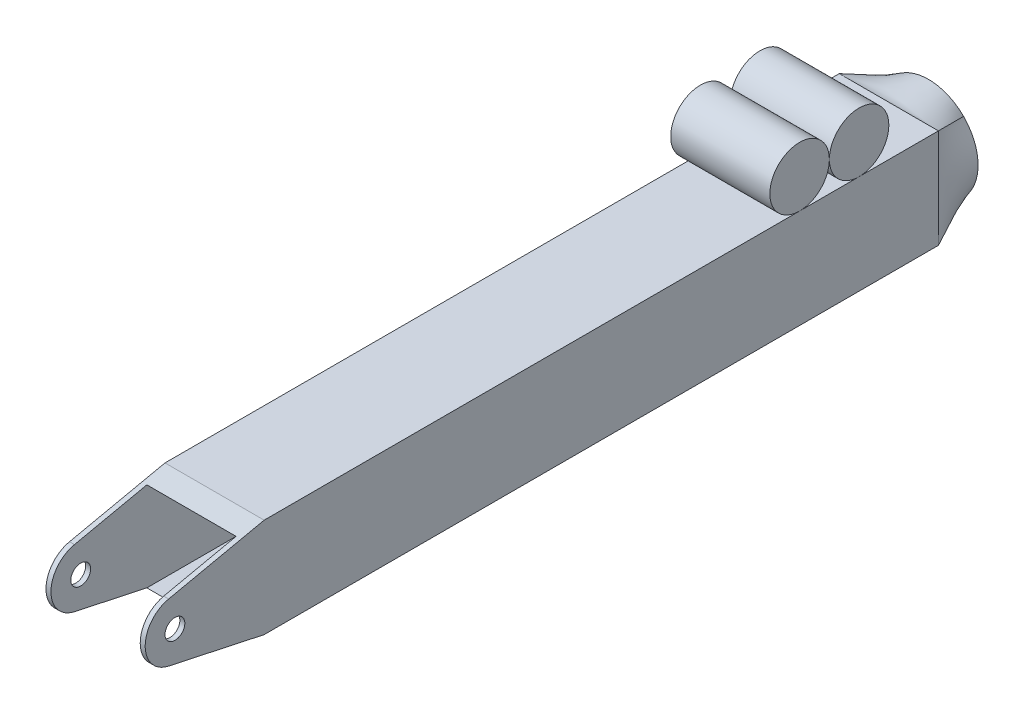
ISO-10303-21;
HEADER;
FILE_DESCRIPTION(('STEP AP214'),'2;1');
FILE_NAME('part.step','',(''),(''),'','','');
FILE_SCHEMA(('AUTOMOTIVE_DESIGN { 1 0 10303 214 1 1 1 1 }'));
ENDSEC;
DATA;
#1=APPLICATION_CONTEXT('core data for automotive mechanical design processes');
#2=APPLICATION_PROTOCOL_DEFINITION('international standard','automotive_design',2000,#1);
#3=PRODUCT_CONTEXT('',#1,'mechanical');
#4=PRODUCT('Part','Part','',(#3));
#5=PRODUCT_RELATED_PRODUCT_CATEGORY('part','',(#4));
#6=PRODUCT_DEFINITION_FORMATION('','',#4);
#7=PRODUCT_DEFINITION_CONTEXT('part definition',#1,'design');
#8=PRODUCT_DEFINITION('design','',#6,#7);
#9=PRODUCT_DEFINITION_SHAPE('','',#8);
#10=(LENGTH_UNIT() NAMED_UNIT(*) SI_UNIT(.MILLI.,.METRE.));
#11=(NAMED_UNIT(*) PLANE_ANGLE_UNIT() SI_UNIT($,.RADIAN.));
#12=(NAMED_UNIT(*) SI_UNIT($,.STERADIAN.) SOLID_ANGLE_UNIT());
#13=UNCERTAINTY_MEASURE_WITH_UNIT(LENGTH_MEASURE(1.E-05),#10,'distance_accuracy_value','');
#14=(GEOMETRIC_REPRESENTATION_CONTEXT(3) GLOBAL_UNCERTAINTY_ASSIGNED_CONTEXT((#13)) GLOBAL_UNIT_ASSIGNED_CONTEXT((#10,
#11,#12)) REPRESENTATION_CONTEXT('',''));
#15=CARTESIAN_POINT('',(0.,0.,0.));
#16=DIRECTION('',(0.,0.,1.));
#17=DIRECTION('',(1.,0.,0.));
#18=AXIS2_PLACEMENT_3D('',#15,#16,#17);
#19=CARTESIAN_POINT('',(-85.631536726415,50.8,76.2));
#20=DIRECTION('',(1.,0.,0.));
#21=DIRECTION('',(0.,0.,-1.));
#22=AXIS2_PLACEMENT_3D('',#19,#20,#21);
#23=CYLINDRICAL_SURFACE('',#22,19.05);
#24=CARTESIAN_POINT('',(-31.75,50.8,76.2));
#25=DIRECTION('',(1.,0.,0.));
#26=DIRECTION('',(0.,0.,-1.));
#27=AXIS2_PLACEMENT_3D('',#24,#25,#26);
#28=CIRCLE('',#27,19.05);
#29=CARTESIAN_POINT('',(-31.75,50.8,57.15));
#30=VERTEX_POINT('',#29);
#31=EDGE_CURVE('E12',#30,#30,#28,.F.);
#32=ORIENTED_EDGE('',*,*,#31,.F.);
#33=EDGE_LOOP('',(#32));
#34=FACE_BOUND('',#33,.T.);
#35=CARTESIAN_POINT('',(31.75,50.8,76.2));
#36=DIRECTION('',(1.,0.,0.));
#37=DIRECTION('',(0.,0.,-1.));
#38=AXIS2_PLACEMENT_3D('',#35,#36,#37);
#39=CIRCLE('',#38,19.05);
#40=CARTESIAN_POINT('',(31.75,50.8,57.15));
#41=VERTEX_POINT('',#40);
#42=EDGE_CURVE('E139',#41,#41,#39,.T.);
#43=ORIENTED_EDGE('',*,*,#42,.F.);
#44=EDGE_LOOP('',(#43));
#45=FACE_BOUND('',#44,.T.);
#46=ADVANCED_FACE('F133',(#34,#45),#23,.T.);
#47=CARTESIAN_POINT('',(31.75,0.,0.));
#48=DIRECTION('',(1.,0.,0.));
#49=DIRECTION('',(0.,0.,-1.));
#50=AXIS2_PLACEMENT_3D('',#47,#48,#49);
#51=PLANE('',#50);
#52=ORIENTED_EDGE('',*,*,#42,.T.);
#53=EDGE_LOOP('',(#52));
#54=FACE_BOUND('',#53,.T.);
#55=ADVANCED_FACE('F145',(#54),#51,.T.);
#56=CARTESIAN_POINT('',(-31.75,-31.75,533.4));
#57=DIRECTION('',(1.,0.,0.));
#58=DIRECTION('',(0.,0.,-1.));
#59=AXIS2_PLACEMENT_3D('',#56,#57,#58);
#60=PLANE('',#59);
#61=ORIENTED_EDGE('',*,*,#31,.T.);
#62=EDGE_LOOP('',(#61));
#63=FACE_BOUND('',#62,.T.);
#64=ADVANCED_FACE('F152',(#63),#60,.F.);
#65=CLOSED_SHELL('',(#46,#55,#64));
#66=MANIFOLD_SOLID_BREP('B2',#65);
#67=CARTESIAN_POINT('',(-85.631536726415,50.8,114.3));
#68=DIRECTION('',(1.,0.,0.));
#69=DIRECTION('',(0.,0.,-1.));
#70=AXIS2_PLACEMENT_3D('',#67,#68,#69);
#71=CYLINDRICAL_SURFACE('',#70,19.05);
#72=CARTESIAN_POINT('',(-31.75,50.8,114.3));
#73=DIRECTION('',(1.,0.,0.));
#74=DIRECTION('',(0.,0.,-1.));
#75=AXIS2_PLACEMENT_3D('',#72,#73,#74);
#76=CIRCLE('',#75,19.05);
#77=CARTESIAN_POINT('',(-31.75,50.8,95.25));
#78=VERTEX_POINT('',#77);
#79=EDGE_CURVE('E132',#78,#78,#76,.F.);
#80=ORIENTED_EDGE('',*,*,#79,.F.);
#81=EDGE_LOOP('',(#80));
#82=FACE_BOUND('',#81,.T.);
#83=CARTESIAN_POINT('',(31.75,50.8,114.3));
#84=DIRECTION('',(1.,0.,0.));
#85=DIRECTION('',(0.,0.,-1.));
#86=AXIS2_PLACEMENT_3D('',#83,#84,#85);
#87=CIRCLE('',#86,19.05);
#88=CARTESIAN_POINT('',(31.75,50.8,95.25));
#89=VERTEX_POINT('',#88);
#90=EDGE_CURVE('E189',#89,#89,#87,.T.);
#91=ORIENTED_EDGE('',*,*,#90,.F.);
#92=EDGE_LOOP('',(#91));
#93=FACE_BOUND('',#92,.T.);
#94=ADVANCED_FACE('F183',(#82,#93),#71,.T.);
#95=CARTESIAN_POINT('',(31.75,0.,0.));
#96=DIRECTION('',(1.,0.,0.));
#97=DIRECTION('',(0.,0.,-1.));
#98=AXIS2_PLACEMENT_3D('',#95,#96,#97);
#99=PLANE('',#98);
#100=ORIENTED_EDGE('',*,*,#90,.T.);
#101=EDGE_LOOP('',(#100));
#102=FACE_BOUND('',#101,.T.);
#103=ADVANCED_FACE('F195',(#102),#99,.T.);
#104=CARTESIAN_POINT('',(-31.75,-31.75,533.4));
#105=DIRECTION('',(1.,0.,0.));
#106=DIRECTION('',(0.,0.,-1.));
#107=AXIS2_PLACEMENT_3D('',#104,#105,#106);
#108=PLANE('',#107);
#109=ORIENTED_EDGE('',*,*,#79,.T.);
#110=EDGE_LOOP('',(#109));
#111=FACE_BOUND('',#110,.T.);
#112=ADVANCED_FACE('F202',(#111),#108,.F.);
#113=CLOSED_SHELL('',(#94,#103,#112));
#114=MANIFOLD_SOLID_BREP('B7',#113);
#115=CARTESIAN_POINT('',(31.75,-31.75,533.4));
#116=DIRECTION('',(-1.,0.,0.));
#117=DIRECTION('',(0.,0.,1.));
#118=AXIS2_PLACEMENT_3D('',#115,#116,#117);
#119=PLANE('',#118);
#120=CARTESIAN_POINT('',(31.75,0.,514.35));
#121=DIRECTION('',(1.,0.,0.));
#122=DIRECTION('',(0.,0.,-1.));
#123=AXIS2_PLACEMENT_3D('',#120,#121,#122);
#124=CIRCLE('',#123,6.34999999999994);
#125=CARTESIAN_POINT('',(31.75,0.,508.));
#126=VERTEX_POINT('',#125);
#127=EDGE_CURVE('E355',#126,#126,#124,.T.);
#128=ORIENTED_EDGE('',*,*,#127,.F.);
#129=EDGE_LOOP('',(#128));
#130=FACE_BOUND('',#129,.T.);
#131=CARTESIAN_POINT('',(31.75,0.,514.35));
#132=DIRECTION('',(1.,0.,0.));
#133=DIRECTION('',(0.,0.,-1.));
#134=AXIS2_PLACEMENT_3D('',#131,#132,#133);
#135=CIRCLE('',#134,19.05);
#136=CARTESIAN_POINT('',(31.75,18.6258176426221,518.347676468123));
#137=VERTEX_POINT('',#136);
#138=CARTESIAN_POINT('',(31.75,-18.625817642622,518.347676468123));
#139=VERTEX_POINT('',#138);
#140=EDGE_CURVE('E338',#137,#139,#135,.T.);
#141=ORIENTED_EDGE('',*,*,#140,.T.);
#142=DIRECTION('',(0.,-0.20985178310359,-0.977733209586462));
#143=VECTOR('',#142,1.);
#144=CARTESIAN_POINT('',(31.75,-124.159665832419,26.6485039160112));
#145=LINE('',#144,#143);
#146=CARTESIAN_POINT('',(31.75,-31.75,457.2));
#147=VERTEX_POINT('',#146);
#148=EDGE_CURVE('E341',#139,#147,#145,.T.);
#149=ORIENTED_EDGE('',*,*,#148,.T.);
#150=DIRECTION('',(0.,0.,-1.));
#151=VECTOR('',#150,1.);
#152=CARTESIAN_POINT('',(31.75,-31.75,533.4));
#153=LINE('',#152,#151);
#154=CARTESIAN_POINT('',(31.75,-31.75,25.4));
#155=VERTEX_POINT('',#154);
#156=EDGE_CURVE('E479',#147,#155,#153,.T.);
#157=ORIENTED_EDGE('',*,*,#156,.T.);
#158=DIRECTION('',(0.,1.,0.));
#159=VECTOR('',#158,1.);
#160=CARTESIAN_POINT('',(31.75,-31.75,25.4));
#161=LINE('',#160,#159);
#162=CARTESIAN_POINT('',(31.75,31.75,25.4));
#163=VERTEX_POINT('',#162);
#164=EDGE_CURVE('E473',#155,#163,#161,.T.);
#165=ORIENTED_EDGE('',*,*,#164,.T.);
#166=DIRECTION('',(0.,0.,-1.));
#167=VECTOR('',#166,1.);
#168=CARTESIAN_POINT('',(31.75,31.75,533.4));
#169=LINE('',#168,#167);
#170=CARTESIAN_POINT('',(31.75,31.75,457.2));
#171=VERTEX_POINT('',#170);
#172=EDGE_CURVE('E268',#171,#163,#169,.T.);
#173=ORIENTED_EDGE('',*,*,#172,.F.);
#174=DIRECTION('',(0.,0.20985178310359,-0.977733209586462));
#175=VECTOR('',#174,1.);
#176=CARTESIAN_POINT('',(31.75,124.159665832419,26.6485039160111));
#177=LINE('',#176,#175);
#178=EDGE_CURVE('E343',#137,#171,#177,.T.);
#179=ORIENTED_EDGE('',*,*,#178,.F.);
#180=EDGE_LOOP('',(#141,#149,#157,#165,#173,#179));
#181=FACE_BOUND('',#180,.T.);
#182=ADVANCED_FACE('F224',(#130,#181),#119,.F.);
#183=CARTESIAN_POINT('',(-31.75,-31.75,533.4));
#184=DIRECTION('',(1.,0.,0.));
#185=DIRECTION('',(0.,0.,-1.));
#186=AXIS2_PLACEMENT_3D('',#183,#184,#185);
#187=PLANE('',#186);
#188=CARTESIAN_POINT('',(-31.75,0.,514.35));
#189=DIRECTION('',(1.,0.,0.));
#190=DIRECTION('',(0.,0.,-1.));
#191=AXIS2_PLACEMENT_3D('',#188,#189,#190);
#192=CIRCLE('',#191,6.34999999999994);
#193=CARTESIAN_POINT('',(-31.75,0.,508.));
#194=VERTEX_POINT('',#193);
#195=EDGE_CURVE('E346',#194,#194,#192,.T.);
#196=ORIENTED_EDGE('',*,*,#195,.T.);
#197=EDGE_LOOP('',(#196));
#198=FACE_BOUND('',#197,.T.);
#199=DIRECTION('',(0.,-0.20985178310359,-0.977733209586462));
#200=VECTOR('',#199,1.);
#201=CARTESIAN_POINT('',(-31.75,-16.1153558237338,530.044321859572));
#202=LINE('',#201,#200);
#203=CARTESIAN_POINT('',(-31.75,-18.625817642622,518.347676468123));
#204=VERTEX_POINT('',#203);
#205=CARTESIAN_POINT('',(-31.75,-31.75,457.2));
#206=VERTEX_POINT('',#205);
#207=EDGE_CURVE('E368',#204,#206,#202,.T.);
#208=ORIENTED_EDGE('',*,*,#207,.F.);
#209=CARTESIAN_POINT('',(-31.75,0.,514.35));
#210=DIRECTION('',(1.,0.,0.));
#211=DIRECTION('',(0.,0.,-1.));
#212=AXIS2_PLACEMENT_3D('',#209,#210,#211);
#213=CIRCLE('',#212,19.05);
#214=CARTESIAN_POINT('',(-31.75,18.6258176426221,518.347676468123));
#215=VERTEX_POINT('',#214);
#216=EDGE_CURVE('E389',#215,#204,#213,.T.);
#217=ORIENTED_EDGE('',*,*,#216,.F.);
#218=DIRECTION('',(0.,0.20985178310359,-0.977733209586462));
#219=VECTOR('',#218,1.);
#220=CARTESIAN_POINT('',(-31.75,13.3189573733774,543.073192006461));
#221=LINE('',#220,#219);
#222=CARTESIAN_POINT('',(-31.75,31.75,457.2));
#223=VERTEX_POINT('',#222);
#224=EDGE_CURVE('E384',#215,#223,#221,.T.);
#225=ORIENTED_EDGE('',*,*,#224,.T.);
#226=DIRECTION('',(0.,0.,-1.));
#227=VECTOR('',#226,1.);
#228=CARTESIAN_POINT('',(-31.75,31.75,533.4));
#229=LINE('',#228,#227);
#230=CARTESIAN_POINT('',(-31.75,31.75,25.4));
#231=VERTEX_POINT('',#230);
#232=EDGE_CURVE('E474',#223,#231,#229,.T.);
#233=ORIENTED_EDGE('',*,*,#232,.T.);
#234=DIRECTION('',(0.,1.,0.));
#235=VECTOR('',#234,1.);
#236=CARTESIAN_POINT('',(-31.75,-31.75,25.4));
#237=LINE('',#236,#235);
#238=CARTESIAN_POINT('',(-31.75,-31.75,25.4));
#239=VERTEX_POINT('',#238);
#240=EDGE_CURVE('E485',#231,#239,#237,.F.);
#241=ORIENTED_EDGE('',*,*,#240,.T.);
#242=DIRECTION('',(0.,0.,-1.));
#243=VECTOR('',#242,1.);
#244=CARTESIAN_POINT('',(-31.75,-31.75,533.4));
#245=LINE('',#244,#243);
#246=EDGE_CURVE('E476',#206,#239,#245,.T.);
#247=ORIENTED_EDGE('',*,*,#246,.F.);
#248=EDGE_LOOP('',(#208,#217,#225,#233,#241,#247));
#249=FACE_BOUND('',#248,.T.);
#250=ADVANCED_FACE('F510',(#198,#249),#187,.F.);
#251=CARTESIAN_POINT('',(-28.575,-28.575,533.4));
#252=DIRECTION('',(1.,0.,0.));
#253=DIRECTION('',(0.,0.,-1.));
#254=AXIS2_PLACEMENT_3D('',#251,#252,#253);
#255=PLANE('',#254);
#256=CARTESIAN_POINT('',(-28.575,0.,514.35));
#257=DIRECTION('',(1.,0.,0.));
#258=DIRECTION('',(0.,0.,-1.));
#259=AXIS2_PLACEMENT_3D('',#256,#257,#258);
#260=CIRCLE('',#259,6.34999999999994);
#261=CARTESIAN_POINT('',(-28.575,0.,508.));
#262=VERTEX_POINT('',#261);
#263=EDGE_CURVE('E370',#262,#262,#260,.T.);
#264=ORIENTED_EDGE('',*,*,#263,.F.);
#265=EDGE_LOOP('',(#264));
#266=FACE_BOUND('',#265,.T.);
#267=CARTESIAN_POINT('',(-28.575,0.,514.35));
#268=DIRECTION('',(1.,0.,0.));
#269=DIRECTION('',(0.,0.,-1.));
#270=AXIS2_PLACEMENT_3D('',#267,#268,#269);
#271=CIRCLE('',#270,19.05);
#272=CARTESIAN_POINT('',(-28.575,18.6258176426221,518.347676468123));
#273=VERTEX_POINT('',#272);
#274=CARTESIAN_POINT('',(-28.575,-18.625817642622,518.347676468123));
#275=VERTEX_POINT('',#274);
#276=EDGE_CURVE('E387',#273,#275,#271,.T.);
#277=ORIENTED_EDGE('',*,*,#276,.T.);
#278=DIRECTION('',(0.,-0.20985178310359,-0.977733209586462));
#279=VECTOR('',#278,1.);
#280=CARTESIAN_POINT('',(-28.575,-15.975535901216,530.695765366917));
#281=LINE('',#280,#279);
#282=CARTESIAN_POINT('',(-28.575,-28.575,471.992835660132));
#283=VERTEX_POINT('',#282);
#284=EDGE_CURVE('E362',#275,#283,#281,.T.);
#285=ORIENTED_EDGE('',*,*,#284,.T.);
#286=DIRECTION('',(0.,0.,-1.));
#287=VECTOR('',#286,1.);
#288=CARTESIAN_POINT('',(-28.575,-28.575,533.4));
#289=LINE('',#288,#287);
#290=CARTESIAN_POINT('',(-28.575,-28.575,25.4));
#291=VERTEX_POINT('',#290);
#292=EDGE_CURVE('E471',#283,#291,#289,.T.);
#293=ORIENTED_EDGE('',*,*,#292,.T.);
#294=DIRECTION('',(0.,-1.,0.));
#295=VECTOR('',#294,1.);
#296=CARTESIAN_POINT('',(-28.575,-28.575,25.4));
#297=LINE('',#296,#295);
#298=CARTESIAN_POINT('',(-28.575,28.575,25.4));
#299=VERTEX_POINT('',#298);
#300=EDGE_CURVE('E448',#299,#291,#297,.T.);
#301=ORIENTED_EDGE('',*,*,#300,.F.);
#302=DIRECTION('',(0.,0.,-1.));
#303=VECTOR('',#302,1.);
#304=CARTESIAN_POINT('',(-28.575,28.575,533.4));
#305=LINE('',#304,#303);
#306=CARTESIAN_POINT('',(-28.575,28.575,471.992835660132));
#307=VERTEX_POINT('',#306);
#308=EDGE_CURVE('E247',#307,#299,#305,.T.);
#309=ORIENTED_EDGE('',*,*,#308,.F.);
#310=DIRECTION('',(0.,0.20985178310359,-0.977733209586462));
#311=VECTOR('',#310,1.);
#312=CARTESIAN_POINT('',(-28.575,13.4587772958952,542.421748499116));
#313=LINE('',#312,#311);
#314=EDGE_CURVE('E239',#273,#307,#313,.T.);
#315=ORIENTED_EDGE('',*,*,#314,.F.);
#316=EDGE_LOOP('',(#277,#285,#293,#301,#309,#315));
#317=FACE_BOUND('',#316,.T.);
#318=ADVANCED_FACE('F501',(#266,#317),#255,.T.);
#319=CARTESIAN_POINT('',(28.575,-28.575,533.4));
#320=DIRECTION('',(-1.,0.,0.));
#321=DIRECTION('',(0.,-1.,0.));
#322=AXIS2_PLACEMENT_3D('',#319,#320,#321);
#323=PLANE('',#322);
#324=CARTESIAN_POINT('',(28.575,0.,514.35));
#325=DIRECTION('',(-1.,0.,0.));
#326=DIRECTION('',(0.,-1.,0.));
#327=AXIS2_PLACEMENT_3D('',#324,#325,#326);
#328=CIRCLE('',#327,6.34999999999994);
#329=CARTESIAN_POINT('',(28.575,-6.34999999999994,514.35));
#330=VERTEX_POINT('',#329);
#331=EDGE_CURVE('E227',#330,#330,#328,.T.);
#332=ORIENTED_EDGE('',*,*,#331,.F.);
#333=EDGE_LOOP('',(#332));
#334=FACE_BOUND('',#333,.T.);
#335=DIRECTION('',(0.,0.20985178310359,0.977733209586462));
#336=VECTOR('',#335,1.);
#337=CARTESIAN_POINT('',(28.575,-15.975535901216,530.695765366917));
#338=LINE('',#337,#336);
#339=CARTESIAN_POINT('',(28.575,-28.575,471.992835660132));
#340=VERTEX_POINT('',#339);
#341=CARTESIAN_POINT('',(28.575,-18.625817642622,518.347676468123));
#342=VERTEX_POINT('',#341);
#343=EDGE_CURVE('E360',#340,#342,#338,.T.);
#344=ORIENTED_EDGE('',*,*,#343,.T.);
#345=CARTESIAN_POINT('',(28.575,0.,514.35));
#346=DIRECTION('',(-1.,0.,0.));
#347=DIRECTION('',(0.,-1.,0.));
#348=AXIS2_PLACEMENT_3D('',#345,#346,#347);
#349=CIRCLE('',#348,19.05);
#350=CARTESIAN_POINT('',(28.575,18.6258176426221,518.347676468123));
#351=VERTEX_POINT('',#350);
#352=EDGE_CURVE('E232',#342,#351,#349,.T.);
#353=ORIENTED_EDGE('',*,*,#352,.T.);
#354=DIRECTION('',(0.,-0.20985178310359,0.977733209586462));
#355=VECTOR('',#354,1.);
#356=CARTESIAN_POINT('',(28.575,13.4587772958952,542.421748499116));
#357=LINE('',#356,#355);
#358=CARTESIAN_POINT('',(28.575,28.575,471.992835660132));
#359=VERTEX_POINT('',#358);
#360=EDGE_CURVE('E379',#359,#351,#357,.T.);
#361=ORIENTED_EDGE('',*,*,#360,.F.);
#362=DIRECTION('',(0.,0.,-1.));
#363=VECTOR('',#362,1.);
#364=CARTESIAN_POINT('',(28.575,28.575,533.4));
#365=LINE('',#364,#363);
#366=CARTESIAN_POINT('',(28.575,28.575,25.4));
#367=VERTEX_POINT('',#366);
#368=EDGE_CURVE('E277',#359,#367,#365,.T.);
#369=ORIENTED_EDGE('',*,*,#368,.T.);
#370=DIRECTION('',(0.,1.,0.));
#371=VECTOR('',#370,1.);
#372=CARTESIAN_POINT('',(28.575,-28.575,25.4));
#373=LINE('',#372,#371);
#374=CARTESIAN_POINT('',(28.575,-28.575,25.4));
#375=VERTEX_POINT('',#374);
#376=EDGE_CURVE('E460',#375,#367,#373,.T.);
#377=ORIENTED_EDGE('',*,*,#376,.F.);
#378=DIRECTION('',(0.,0.,-1.));
#379=VECTOR('',#378,1.);
#380=CARTESIAN_POINT('',(28.575,-28.575,533.4));
#381=LINE('',#380,#379);
#382=EDGE_CURVE('E468',#340,#375,#381,.T.);
#383=ORIENTED_EDGE('',*,*,#382,.F.);
#384=EDGE_LOOP('',(#344,#353,#361,#369,#377,#383));
#385=FACE_BOUND('',#384,.T.);
#386=ADVANCED_FACE('F493',(#334,#385),#323,.T.);
#387=CARTESIAN_POINT('',(-31.75,-31.75,533.4));
#388=DIRECTION('',(0.,1.,0.));
#389=DIRECTION('',(0.,0.,1.));
#390=AXIS2_PLACEMENT_3D('',#387,#388,#389);
#391=PLANE('',#390);
#392=DIRECTION('',(1.,0.,0.));
#393=VECTOR('',#392,1.);
#394=CARTESIAN_POINT('',(-31.7555961775506,-31.75,457.2));
#395=LINE('',#394,#393);
#396=EDGE_CURVE('E359',#206,#147,#395,.T.);
#397=ORIENTED_EDGE('',*,*,#396,.F.);
#398=ORIENTED_EDGE('',*,*,#246,.T.);
#399=DIRECTION('',(1.,0.,0.));
#400=VECTOR('',#399,1.);
#401=CARTESIAN_POINT('',(-31.75,-31.75,25.4));
#402=LINE('',#401,#400);
#403=EDGE_CURVE('E481',#239,#155,#402,.T.);
#404=ORIENTED_EDGE('',*,*,#403,.T.);
#405=ORIENTED_EDGE('',*,*,#156,.F.);
#406=EDGE_LOOP('',(#397,#398,#404,#405));
#407=FACE_BOUND('',#406,.T.);
#408=ADVANCED_FACE('F514',(#407),#391,.F.);
#409=CARTESIAN_POINT('',(-28.575,-28.575,533.4));
#410=DIRECTION('',(0.,1.,0.));
#411=DIRECTION('',(0.,0.,1.));
#412=AXIS2_PLACEMENT_3D('',#409,#410,#411);
#413=PLANE('',#412);
#414=ORIENTED_EDGE('',*,*,#292,.F.);
#415=DIRECTION('',(1.,0.,0.));
#416=VECTOR('',#415,1.);
#417=CARTESIAN_POINT('',(-28.575,-28.575,471.992835660132));
#418=LINE('',#417,#416);
#419=EDGE_CURVE('E181',#283,#340,#418,.T.);
#420=ORIENTED_EDGE('',*,*,#419,.T.);
#421=ORIENTED_EDGE('',*,*,#382,.T.);
#422=DIRECTION('',(1.,0.,0.));
#423=VECTOR('',#422,1.);
#424=CARTESIAN_POINT('',(-28.575,-28.575,25.4));
#425=LINE('',#424,#423);
#426=EDGE_CURVE('E456',#291,#375,#425,.T.);
#427=ORIENTED_EDGE('',*,*,#426,.F.);
#428=EDGE_LOOP('',(#414,#420,#421,#427));
#429=FACE_BOUND('',#428,.T.);
#430=ADVANCED_FACE('F498',(#429),#413,.T.);
#431=CARTESIAN_POINT('',(-31.75,31.75,533.4));
#432=DIRECTION('',(0.,-1.,0.));
#433=DIRECTION('',(0.,0.,-1.));
#434=AXIS2_PLACEMENT_3D('',#431,#432,#433);
#435=PLANE('',#434);
#436=ORIENTED_EDGE('',*,*,#232,.F.);
#437=DIRECTION('',(1.,0.,0.));
#438=VECTOR('',#437,1.);
#439=CARTESIAN_POINT('',(-31.7555961775506,31.75,457.2));
#440=LINE('',#439,#438);
#441=EDGE_CURVE('E377',#223,#171,#440,.T.);
#442=ORIENTED_EDGE('',*,*,#441,.T.);
#443=ORIENTED_EDGE('',*,*,#172,.T.);
#444=DIRECTION('',(1.,0.,0.));
#445=VECTOR('',#444,1.);
#446=CARTESIAN_POINT('',(-31.75,31.75,25.4));
#447=LINE('',#446,#445);
#448=EDGE_CURVE('E483',#163,#231,#447,.F.);
#449=ORIENTED_EDGE('',*,*,#448,.T.);
#450=EDGE_LOOP('',(#436,#442,#443,#449));
#451=FACE_BOUND('',#450,.T.);
#452=ADVANCED_FACE('F607',(#451),#435,.F.);
#453=CARTESIAN_POINT('',(-28.575,28.575,533.4));
#454=DIRECTION('',(0.,-1.,0.));
#455=DIRECTION('',(1.,0.,0.));
#456=AXIS2_PLACEMENT_3D('',#453,#454,#455);
#457=PLANE('',#456);
#458=DIRECTION('',(1.,0.,0.));
#459=VECTOR('',#458,1.);
#460=CARTESIAN_POINT('',(-28.575,28.575,471.992835660132));
#461=LINE('',#460,#459);
#462=EDGE_CURVE('E478',#307,#359,#461,.T.);
#463=ORIENTED_EDGE('',*,*,#462,.F.);
#464=ORIENTED_EDGE('',*,*,#308,.T.);
#465=DIRECTION('',(-1.,0.,0.));
#466=VECTOR('',#465,1.);
#467=CARTESIAN_POINT('',(-28.575,28.575,25.4));
#468=LINE('',#467,#466);
#469=EDGE_CURVE('E463',#367,#299,#468,.T.);
#470=ORIENTED_EDGE('',*,*,#469,.F.);
#471=ORIENTED_EDGE('',*,*,#368,.F.);
#472=EDGE_LOOP('',(#463,#464,#470,#471));
#473=FACE_BOUND('',#472,.T.);
#474=ADVANCED_FACE('F609',(#473),#457,.T.);
#475=CARTESIAN_POINT('',(0.,0.,25.4));
#476=DIRECTION('',(0.,0.,1.));
#477=DIRECTION('',(1.,0.,0.));
#478=AXIS2_PLACEMENT_3D('',#475,#476,#477);
#479=PLANE('',#478);
#480=ORIENTED_EDGE('',*,*,#376,.T.);
#481=ORIENTED_EDGE('',*,*,#469,.T.);
#482=ORIENTED_EDGE('',*,*,#300,.T.);
#483=ORIENTED_EDGE('',*,*,#426,.T.);
#484=EDGE_LOOP('',(#480,#481,#482,#483));
#485=FACE_BOUND('',#484,.T.);
#486=ADVANCED_FACE('F432',(#485),#479,.T.);
#487=CARTESIAN_POINT('',(0.,0.,0.));
#488=DIRECTION('',(0.,0.,1.));
#489=DIRECTION('',(1.,0.,0.));
#490=AXIS2_PLACEMENT_3D('',#487,#488,#489);
#491=PLANE('',#490);
#492=CARTESIAN_POINT('',(0.,0.,0.));
#493=DIRECTION('',(0.,0.,1.));
#494=DIRECTION('',(1.,0.,0.));
#495=AXIS2_PLACEMENT_3D('',#492,#493,#494);
#496=CIRCLE('',#495,31.75);
#497=CARTESIAN_POINT('',(-22.4506403026729,-22.4506403026729,0.));
#498=VERTEX_POINT('',#497);
#499=CARTESIAN_POINT('',(22.4506403026729,-22.4506403026729,0.));
#500=VERTEX_POINT('',#499);
#501=EDGE_CURVE('E399',#498,#500,#496,.T.);
#502=ORIENTED_EDGE('',*,*,#501,.F.);
#503=CARTESIAN_POINT('',(-22.4506403026729,22.4506403026729,0.));
#504=VERTEX_POINT('',#503);
#505=EDGE_CURVE('E391',#504,#498,#496,.T.);
#506=ORIENTED_EDGE('',*,*,#505,.F.);
#507=CARTESIAN_POINT('',(22.4506403026729,22.4506403026729,0.));
#508=VERTEX_POINT('',#507);
#509=EDGE_CURVE('E409',#508,#504,#496,.T.);
#510=ORIENTED_EDGE('',*,*,#509,.F.);
#511=EDGE_CURVE('E406',#500,#508,#496,.T.);
#512=ORIENTED_EDGE('',*,*,#511,.F.);
#513=EDGE_LOOP('',(#502,#506,#510,#512));
#514=FACE_BOUND('',#513,.T.);
#515=ADVANCED_FACE('F421',(#514),#491,.F.);
#516=CARTESIAN_POINT('',(22.4506403026729,22.4506403026729,0.));
#517=CARTESIAN_POINT('',(31.75,31.75,25.4));
#518=CARTESIAN_POINT('',(21.1277236360062,23.7735569693395,0.));
#519=CARTESIAN_POINT('',(29.1041666666667,31.75,25.4));
#520=CARTESIAN_POINT('',(19.6377303136963,25.0283417909468,0.));
#521=CARTESIAN_POINT('',(26.4583333333333,31.75,25.4));
#522=CARTESIAN_POINT('',(16.3435658781563,27.2937025532317,0.));
#523=CARTESIAN_POINT('',(21.1666666666667,31.75,25.4));
#524=CARTESIAN_POINT('',(14.5392265401228,28.3035450280792,0.));
#525=CARTESIAN_POINT('',(18.5208333333333,31.75,25.4));
#526=CARTESIAN_POINT('',(10.6815350260682,29.9730642248736,0.));
#527=CARTESIAN_POINT('',(13.2291666666667,31.75,25.4));
#528=CARTESIAN_POINT('',(8.62848487200939,30.6319226360493,0.));
#529=CARTESIAN_POINT('',(10.5833333333333,31.75,25.4));
#530=CARTESIAN_POINT('',(4.38326675590576,31.5206663653225,0.));
#531=CARTESIAN_POINT('',(5.29166666666666,31.75,25.4));
#532=CARTESIAN_POINT('',(2.19188010089096,31.75,0.));
#533=CARTESIAN_POINT('',(2.64583333333333,31.75,25.4));
#534=CARTESIAN_POINT('',(-2.19188010089096,31.75,0.));
#535=CARTESIAN_POINT('',(-2.64583333333334,31.75,25.4));
#536=CARTESIAN_POINT('',(-4.38326675590576,31.5206663653225,0.));
#537=CARTESIAN_POINT('',(-5.29166666666667,31.75,25.4));
#538=CARTESIAN_POINT('',(-8.62848487200939,30.6319226360493,0.));
#539=CARTESIAN_POINT('',(-10.5833333333333,31.75,25.4));
#540=CARTESIAN_POINT('',(-10.6815350260682,29.9730642248736,0.));
#541=CARTESIAN_POINT('',(-13.2291666666667,31.75,25.4));
#542=CARTESIAN_POINT('',(-14.5392265401228,28.3035450280792,0.));
#543=CARTESIAN_POINT('',(-18.5208333333333,31.75,25.4));
#544=CARTESIAN_POINT('',(-16.3435658781563,27.2937025532317,0.));
#545=CARTESIAN_POINT('',(-21.1666666666667,31.75,25.4));
#546=CARTESIAN_POINT('',(-19.6377303136963,25.0283417909468,0.));
#547=CARTESIAN_POINT('',(-26.4583333333333,31.75,25.4));
#548=CARTESIAN_POINT('',(-21.1277236360062,23.7735569693396,0.));
#549=CARTESIAN_POINT('',(-29.1041666666667,31.75,25.4));
#550=CARTESIAN_POINT('',(-22.4506403026729,22.4506403026729,0.));
#551=CARTESIAN_POINT('',(-31.75,31.75,25.4));
#552=B_SPLINE_SURFACE_WITH_KNOTS('',3,1,((#516,#517),(#518,#519),(#520,#521),(#522,#523),(#524,
#525),(#526,#527),(#528,#529),(#530,#531),(#532,#533),(#534,#535),(#536,#537),(#538,#539),(#540,
#541),(#542,#543),(#544,#545),(#546,#547),(#548,#549),(#550,#551)),.UNSPECIFIED.,.F.,.F.,.F.,(4,
2,2,2,2,2,2,2,4),(2,2),(0.,0.125,0.25,0.375,0.5,0.625,0.75,0.875,1.),(0.,1.),.UNSPECIFIED.);
#553=DIRECTION('',(-0.32512139905576,0.325121399055761,0.888027112059114));
#554=VECTOR('',#553,1.);
#555=CARTESIAN_POINT('',(-27.1003201513364,27.1003201513364,12.7));
#556=LINE('',#555,#554);
#557=EDGE_CURVE('E531',#504,#231,#556,.T.);
#558=DIRECTION('',(-0.32512139905576,-0.32512139905576,-0.888027112059114));
#559=VECTOR('',#558,1.);
#560=CARTESIAN_POINT('',(27.1003201513364,27.1003201513364,12.7));
#561=LINE('',#560,#559);
#562=EDGE_CURVE('E528',#163,#508,#561,.T.);
#563=ORIENTED_EDGE('',*,*,#509,.T.);
#564=ORIENTED_EDGE('',*,*,#557,.T.);
#565=ORIENTED_EDGE('',*,*,#448,.F.);
#566=ORIENTED_EDGE('',*,*,#562,.T.);
#567=EDGE_LOOP('',(#563,#564,#565,#566));
#568=FACE_BOUND('',#567,.T.);
#569=ADVANCED_FACE('F431',(#568),#552,.T.);
#570=CARTESIAN_POINT('',(-22.4506403026729,22.4506403026729,0.));
#571=CARTESIAN_POINT('',(-31.75,31.75,25.4));
#572=CARTESIAN_POINT('',(-23.7735569693396,21.1277236360062,0.));
#573=CARTESIAN_POINT('',(-31.75,29.1041666666667,25.4));
#574=CARTESIAN_POINT('',(-25.0283417909468,19.6377303136963,0.));
#575=CARTESIAN_POINT('',(-31.75,26.4583333333333,25.4));
#576=CARTESIAN_POINT('',(-27.2937025532317,16.3435658781563,0.));
#577=CARTESIAN_POINT('',(-31.75,21.1666666666667,25.4));
#578=CARTESIAN_POINT('',(-28.3035450280792,14.5392265401228,0.));
#579=CARTESIAN_POINT('',(-31.75,18.5208333333333,25.4));
#580=CARTESIAN_POINT('',(-29.9730642248736,10.6815350260682,0.));
#581=CARTESIAN_POINT('',(-31.75,13.2291666666667,25.4));
#582=CARTESIAN_POINT('',(-30.6319226360493,8.62848487200939,0.));
#583=CARTESIAN_POINT('',(-31.75,10.5833333333333,25.4));
#584=CARTESIAN_POINT('',(-31.5206663653225,4.38326675590576,0.));
#585=CARTESIAN_POINT('',(-31.75,5.29166666666666,25.4));
#586=CARTESIAN_POINT('',(-31.75,2.19188010089096,0.));
#587=CARTESIAN_POINT('',(-31.75,2.64583333333333,25.4));
#588=CARTESIAN_POINT('',(-31.75,-2.19188010089096,0.));
#589=CARTESIAN_POINT('',(-31.75,-2.64583333333334,25.4));
#590=CARTESIAN_POINT('',(-31.5206663653225,-4.38326675590576,0.));
#591=CARTESIAN_POINT('',(-31.75,-5.29166666666668,25.4));
#592=CARTESIAN_POINT('',(-30.6319226360493,-8.62848487200939,0.));
#593=CARTESIAN_POINT('',(-31.75,-10.5833333333333,25.4));
#594=CARTESIAN_POINT('',(-29.9730642248736,-10.6815350260682,0.));
#595=CARTESIAN_POINT('',(-31.75,-13.2291666666667,25.4));
#596=CARTESIAN_POINT('',(-28.3035450280792,-14.5392265401228,0.));
#597=CARTESIAN_POINT('',(-31.75,-18.5208333333333,25.4));
#598=CARTESIAN_POINT('',(-27.2937025532317,-16.3435658781563,0.));
#599=CARTESIAN_POINT('',(-31.75,-21.1666666666667,25.4));
#600=CARTESIAN_POINT('',(-25.0283417909468,-19.6377303136963,0.));
#601=CARTESIAN_POINT('',(-31.75,-26.4583333333333,25.4));
#602=CARTESIAN_POINT('',(-23.7735569693396,-21.1277236360062,0.));
#603=CARTESIAN_POINT('',(-31.75,-29.1041666666667,25.4));
#604=CARTESIAN_POINT('',(-22.4506403026729,-22.4506403026729,0.));
#605=CARTESIAN_POINT('',(-31.75,-31.75,25.4));
#606=B_SPLINE_SURFACE_WITH_KNOTS('',3,1,((#570,#571),(#572,#573),(#574,#575),(#576,#577),(#578,
#579),(#580,#581),(#582,#583),(#584,#585),(#586,#587),(#588,#589),(#590,#591),(#592,#593),(#594,
#595),(#596,#597),(#598,#599),(#600,#601),(#602,#603),(#604,#605)),.UNSPECIFIED.,.F.,.F.,.F.,(4,
2,2,2,2,2,2,2,4),(2,2),(0.,0.125,0.25,0.375,0.5,0.625,0.75,0.875,1.),(0.,1.),.UNSPECIFIED.);
#607=DIRECTION('',(-0.32512139905576,-0.325121399055761,0.888027112059114));
#608=VECTOR('',#607,1.);
#609=CARTESIAN_POINT('',(-27.1003201513364,-27.1003201513364,12.7));
#610=LINE('',#609,#608);
#611=EDGE_CURVE('E523',#498,#239,#610,.T.);
#612=ORIENTED_EDGE('',*,*,#505,.T.);
#613=ORIENTED_EDGE('',*,*,#611,.T.);
#614=ORIENTED_EDGE('',*,*,#240,.F.);
#615=ORIENTED_EDGE('',*,*,#557,.F.);
#616=EDGE_LOOP('',(#612,#613,#614,#615));
#617=FACE_BOUND('',#616,.T.);
#618=ADVANCED_FACE('F557',(#617),#606,.T.);
#619=CARTESIAN_POINT('',(22.4506403026729,-22.4506403026729,0.));
#620=CARTESIAN_POINT('',(31.75,-31.75,25.4));
#621=CARTESIAN_POINT('',(23.7735569693395,-21.1277236360062,0.));
#622=CARTESIAN_POINT('',(31.75,-29.1041666666667,25.4));
#623=CARTESIAN_POINT('',(25.0283417909468,-19.6377303136963,0.));
#624=CARTESIAN_POINT('',(31.75,-26.4583333333333,25.4));
#625=CARTESIAN_POINT('',(27.2937025532317,-16.3435658781563,0.));
#626=CARTESIAN_POINT('',(31.75,-21.1666666666667,25.4));
#627=CARTESIAN_POINT('',(28.3035450280792,-14.5392265401228,0.));
#628=CARTESIAN_POINT('',(31.75,-18.5208333333333,25.4));
#629=CARTESIAN_POINT('',(29.9730642248736,-10.6815350260682,0.));
#630=CARTESIAN_POINT('',(31.75,-13.2291666666667,25.4));
#631=CARTESIAN_POINT('',(30.6319226360493,-8.62848487200939,0.));
#632=CARTESIAN_POINT('',(31.75,-10.5833333333333,25.4));
#633=CARTESIAN_POINT('',(31.5206663653225,-4.38326675590577,0.));
#634=CARTESIAN_POINT('',(31.75,-5.29166666666666,25.4));
#635=CARTESIAN_POINT('',(31.75,-2.19188010089096,0.));
#636=CARTESIAN_POINT('',(31.75,-2.64583333333333,25.4));
#637=CARTESIAN_POINT('',(31.75,2.19188010089096,0.));
#638=CARTESIAN_POINT('',(31.75,2.64583333333334,25.4));
#639=CARTESIAN_POINT('',(31.5206663653225,4.38326675590576,0.));
#640=CARTESIAN_POINT('',(31.75,5.29166666666668,25.4));
#641=CARTESIAN_POINT('',(30.6319226360493,8.62848487200939,0.));
#642=CARTESIAN_POINT('',(31.75,10.5833333333334,25.4));
#643=CARTESIAN_POINT('',(29.9730642248736,10.6815350260682,0.));
#644=CARTESIAN_POINT('',(31.75,13.2291666666667,25.4));
#645=CARTESIAN_POINT('',(28.3035450280792,14.5392265401228,0.));
#646=CARTESIAN_POINT('',(31.75,18.5208333333333,25.4));
#647=CARTESIAN_POINT('',(27.2937025532317,16.3435658781563,0.));
#648=CARTESIAN_POINT('',(31.75,21.1666666666667,25.4));
#649=CARTESIAN_POINT('',(25.0283417909468,19.6377303136963,0.));
#650=CARTESIAN_POINT('',(31.75,26.4583333333333,25.4));
#651=CARTESIAN_POINT('',(23.7735569693396,21.1277236360062,0.));
#652=CARTESIAN_POINT('',(31.75,29.1041666666667,25.4));
#653=CARTESIAN_POINT('',(22.4506403026729,22.4506403026729,0.));
#654=CARTESIAN_POINT('',(31.75,31.75,25.4));
#655=B_SPLINE_SURFACE_WITH_KNOTS('',3,1,((#619,#620),(#621,#622),(#623,#624),(#625,#626),(#627,
#628),(#629,#630),(#631,#632),(#633,#634),(#635,#636),(#637,#638),(#639,#640),(#641,#642),(#643,
#644),(#645,#646),(#647,#648),(#649,#650),(#651,#652),(#653,#654)),.UNSPECIFIED.,.F.,.F.,.F.,(4,
2,2,2,2,2,2,2,4),(2,2),(0.,0.125,0.25,0.375,0.5,0.625,0.75,0.875,1.),(0.,1.),.UNSPECIFIED.);
#656=DIRECTION('',(0.325121399055761,-0.32512139905576,0.888027112059114));
#657=VECTOR('',#656,1.);
#658=CARTESIAN_POINT('',(27.1003201513364,-27.1003201513364,12.7));
#659=LINE('',#658,#657);
#660=EDGE_CURVE('E457',#500,#155,#659,.T.);
#661=ORIENTED_EDGE('',*,*,#511,.T.);
#662=ORIENTED_EDGE('',*,*,#562,.F.);
#663=ORIENTED_EDGE('',*,*,#164,.F.);
#664=ORIENTED_EDGE('',*,*,#660,.F.);
#665=EDGE_LOOP('',(#661,#662,#663,#664));
#666=FACE_BOUND('',#665,.T.);
#667=ADVANCED_FACE('F526',(#666),#655,.T.);
#668=CARTESIAN_POINT('',(-22.4506403026729,-22.4506403026729,0.));
#669=CARTESIAN_POINT('',(-31.75,-31.75,25.4));
#670=CARTESIAN_POINT('',(-21.1277236360062,-23.7735569693396,0.));
#671=CARTESIAN_POINT('',(-29.1041666666667,-31.75,25.4));
#672=CARTESIAN_POINT('',(-19.6377303136963,-25.0283417909468,0.));
#673=CARTESIAN_POINT('',(-26.4583333333333,-31.75,25.4));
#674=CARTESIAN_POINT('',(-16.3435658781563,-27.2937025532317,0.));
#675=CARTESIAN_POINT('',(-21.1666666666667,-31.75,25.4));
#676=CARTESIAN_POINT('',(-14.5392265401228,-28.3035450280792,0.));
#677=CARTESIAN_POINT('',(-18.5208333333333,-31.75,25.4));
#678=CARTESIAN_POINT('',(-10.6815350260682,-29.9730642248736,0.));
#679=CARTESIAN_POINT('',(-13.2291666666667,-31.75,25.4));
#680=CARTESIAN_POINT('',(-8.6284848720094,-30.6319226360493,0.));
#681=CARTESIAN_POINT('',(-10.5833333333333,-31.75,25.4));
#682=CARTESIAN_POINT('',(-4.38326675590577,-31.5206663653225,0.));
#683=CARTESIAN_POINT('',(-5.29166666666666,-31.75,25.4));
#684=CARTESIAN_POINT('',(-2.19188010089097,-31.75,0.));
#685=CARTESIAN_POINT('',(-2.64583333333333,-31.75,25.4));
#686=CARTESIAN_POINT('',(2.19188010089095,-31.75,0.));
#687=CARTESIAN_POINT('',(2.64583333333334,-31.75,25.4));
#688=CARTESIAN_POINT('',(4.38326675590575,-31.5206663653225,0.));
#689=CARTESIAN_POINT('',(5.29166666666668,-31.75,25.4));
#690=CARTESIAN_POINT('',(8.62848487200939,-30.6319226360493,0.));
#691=CARTESIAN_POINT('',(10.5833333333333,-31.75,25.4));
#692=CARTESIAN_POINT('',(10.6815350260682,-29.9730642248736,0.));
#693=CARTESIAN_POINT('',(13.2291666666667,-31.75,25.4));
#694=CARTESIAN_POINT('',(14.5392265401228,-28.3035450280792,0.));
#695=CARTESIAN_POINT('',(18.5208333333333,-31.75,25.4));
#696=CARTESIAN_POINT('',(16.3435658781563,-27.2937025532317,0.));
#697=CARTESIAN_POINT('',(21.1666666666667,-31.75,25.4));
#698=CARTESIAN_POINT('',(19.6377303136963,-25.0283417909468,0.));
#699=CARTESIAN_POINT('',(26.4583333333333,-31.75,25.4));
#700=CARTESIAN_POINT('',(21.1277236360062,-23.7735569693396,0.));
#701=CARTESIAN_POINT('',(29.1041666666667,-31.75,25.4));
#702=CARTESIAN_POINT('',(22.4506403026729,-22.4506403026729,0.));
#703=CARTESIAN_POINT('',(31.75,-31.75,25.4));
#704=B_SPLINE_SURFACE_WITH_KNOTS('',3,1,((#668,#669),(#670,#671),(#672,#673),(#674,#675),(#676,
#677),(#678,#679),(#680,#681),(#682,#683),(#684,#685),(#686,#687),(#688,#689),(#690,#691),(#692,
#693),(#694,#695),(#696,#697),(#698,#699),(#700,#701),(#702,#703)),.UNSPECIFIED.,.F.,.F.,.F.,(4,
2,2,2,2,2,2,2,4),(2,2),(0.,0.125,0.25,0.375,0.5,0.625,0.75,0.875,1.),(0.,1.),.UNSPECIFIED.);
#705=ORIENTED_EDGE('',*,*,#501,.T.);
#706=ORIENTED_EDGE('',*,*,#660,.T.);
#707=ORIENTED_EDGE('',*,*,#403,.F.);
#708=ORIENTED_EDGE('',*,*,#611,.F.);
#709=EDGE_LOOP('',(#705,#706,#707,#708));
#710=FACE_BOUND('',#709,.T.);
#711=ADVANCED_FACE('F519',(#710),#704,.T.);
#712=CARTESIAN_POINT('',(-31.7555961775506,0.,514.35));
#713=DIRECTION('',(1.,0.,0.));
#714=DIRECTION('',(0.,0.,-1.));
#715=AXIS2_PLACEMENT_3D('',#712,#713,#714);
#716=CYLINDRICAL_SURFACE('',#715,19.05);
#717=ORIENTED_EDGE('',*,*,#216,.T.);
#718=DIRECTION('',(1.,0.,0.));
#719=VECTOR('',#718,1.);
#720=CARTESIAN_POINT('',(-31.7555961775506,-18.625817642622,518.347676468123));
#721=LINE('',#720,#719);
#722=EDGE_CURVE('E354',#204,#275,#721,.T.);
#723=ORIENTED_EDGE('',*,*,#722,.T.);
#724=ORIENTED_EDGE('',*,*,#276,.F.);
#725=DIRECTION('',(1.,0.,0.));
#726=VECTOR('',#725,1.);
#727=CARTESIAN_POINT('',(-31.7555961775506,18.6258176426221,518.347676468123));
#728=LINE('',#727,#726);
#729=EDGE_CURVE('E380',#215,#273,#728,.T.);
#730=ORIENTED_EDGE('',*,*,#729,.F.);
#731=EDGE_LOOP('',(#717,#723,#724,#730));
#732=FACE_BOUND('',#731,.T.);
#733=ADVANCED_FACE('F506',(#732),#716,.T.);
#734=CARTESIAN_POINT('',(-31.7555961775506,124.159665832419,26.6485039160111));
#735=DIRECTION('',(0.,-0.977733209586462,-0.20985178310359));
#736=DIRECTION('',(0.,0.20985178310359,-0.977733209586462));
#737=AXIS2_PLACEMENT_3D('',#734,#735,#736);
#738=PLANE('',#737);
#739=ORIENTED_EDGE('',*,*,#729,.T.);
#740=ORIENTED_EDGE('',*,*,#314,.T.);
#741=ORIENTED_EDGE('',*,*,#462,.T.);
#742=ORIENTED_EDGE('',*,*,#360,.T.);
#743=EDGE_CURVE('E376',#351,#137,#728,.T.);
#744=ORIENTED_EDGE('',*,*,#743,.T.);
#745=ORIENTED_EDGE('',*,*,#178,.T.);
#746=ORIENTED_EDGE('',*,*,#441,.F.);
#747=ORIENTED_EDGE('',*,*,#224,.F.);
#748=EDGE_LOOP('',(#739,#740,#741,#742,#744,#745,#746,#747));
#749=FACE_BOUND('',#748,.T.);
#750=ADVANCED_FACE('F638',(#749),#738,.F.);
#751=ORIENTED_EDGE('',*,*,#352,.F.);
#752=EDGE_CURVE('E349',#342,#139,#721,.T.);
#753=ORIENTED_EDGE('',*,*,#752,.T.);
#754=ORIENTED_EDGE('',*,*,#140,.F.);
#755=ORIENTED_EDGE('',*,*,#743,.F.);
#756=EDGE_LOOP('',(#751,#753,#754,#755));
#757=FACE_BOUND('',#756,.T.);
#758=ADVANCED_FACE('F350',(#757),#716,.T.);
#759=CARTESIAN_POINT('',(-31.7555961775506,-124.159665832419,26.6485039160112));
#760=DIRECTION('',(0.,-0.977733209586462,0.20985178310359));
#761=DIRECTION('',(0.,-0.20985178310359,-0.977733209586462));
#762=AXIS2_PLACEMENT_3D('',#759,#760,#761);
#763=PLANE('',#762);
#764=ORIENTED_EDGE('',*,*,#207,.T.);
#765=ORIENTED_EDGE('',*,*,#396,.T.);
#766=ORIENTED_EDGE('',*,*,#148,.F.);
#767=ORIENTED_EDGE('',*,*,#752,.F.);
#768=ORIENTED_EDGE('',*,*,#343,.F.);
#769=ORIENTED_EDGE('',*,*,#419,.F.);
#770=ORIENTED_EDGE('',*,*,#284,.F.);
#771=ORIENTED_EDGE('',*,*,#722,.F.);
#772=EDGE_LOOP('',(#764,#765,#766,#767,#768,#769,#770,#771));
#773=FACE_BOUND('',#772,.T.);
#774=ADVANCED_FACE('F357',(#773),#763,.T.);
#775=CARTESIAN_POINT('',(-31.7555961775506,0.,514.35));
#776=DIRECTION('',(1.,0.,0.));
#777=DIRECTION('',(0.,0.,-1.));
#778=AXIS2_PLACEMENT_3D('',#775,#776,#777);
#779=CYLINDRICAL_SURFACE('',#778,6.34999999999994);
#780=ORIENTED_EDGE('',*,*,#331,.T.);
#781=EDGE_LOOP('',(#780));
#782=FACE_BOUND('',#781,.T.);
#783=ORIENTED_EDGE('',*,*,#127,.T.);
#784=EDGE_LOOP('',(#783));
#785=FACE_BOUND('',#784,.T.);
#786=ADVANCED_FACE('F626',(#782,#785),#779,.F.);
#787=ORIENTED_EDGE('',*,*,#263,.T.);
#788=EDGE_LOOP('',(#787));
#789=FACE_BOUND('',#788,.T.);
#790=ORIENTED_EDGE('',*,*,#195,.F.);
#791=EDGE_LOOP('',(#790));
#792=FACE_BOUND('',#791,.T.);
#793=ADVANCED_FACE('F628',(#789,#792),#779,.F.);
#794=CLOSED_SHELL('',(#182,#250,#318,#386,#408,#430,#452,#474,#486,#515,#569,#618,#667,#711,
#733,#750,#758,#774,#786,#793));
#795=MANIFOLD_SOLID_BREP('B127',#794);
#796=ADVANCED_BREP_SHAPE_REPRESENTATION('',(#18,#66,#114,#795),#14);
#797=SHAPE_DEFINITION_REPRESENTATION(#9,#796);
ENDSEC;
END-ISO-10303-21;
